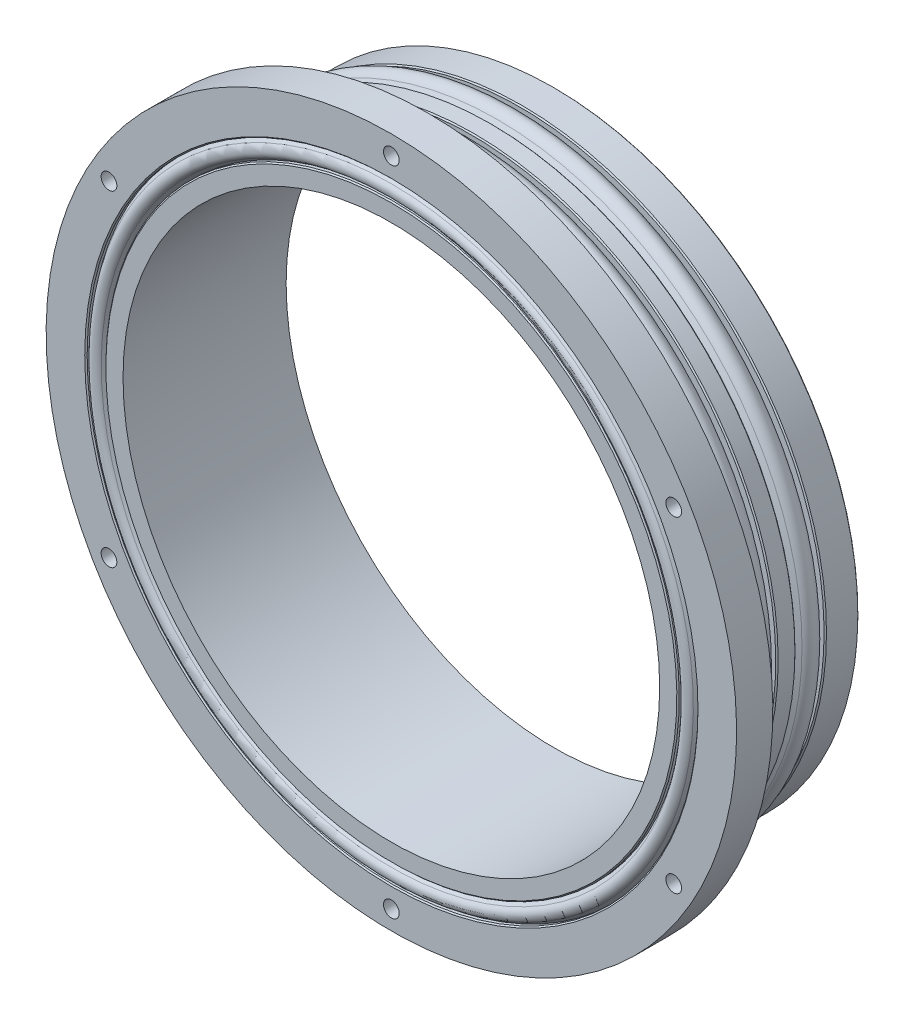
ISO-10303-21;
HEADER;
FILE_DESCRIPTION(('STEP AP214'),'2;1');
FILE_NAME('part.step','',(''),(''),'','','');
FILE_SCHEMA(('AUTOMOTIVE_DESIGN { 1 0 10303 214 1 1 1 1 }'));
ENDSEC;
DATA;
#1=APPLICATION_CONTEXT('core data for automotive mechanical design processes');
#2=APPLICATION_PROTOCOL_DEFINITION('international standard','automotive_design',2000,#1);
#3=PRODUCT_CONTEXT('',#1,'mechanical');
#4=PRODUCT('Part','Part','',(#3));
#5=PRODUCT_RELATED_PRODUCT_CATEGORY('part','',(#4));
#6=PRODUCT_DEFINITION_FORMATION('','',#4);
#7=PRODUCT_DEFINITION_CONTEXT('part definition',#1,'design');
#8=PRODUCT_DEFINITION('design','',#6,#7);
#9=PRODUCT_DEFINITION_SHAPE('','',#8);
#10=(LENGTH_UNIT() NAMED_UNIT(*) SI_UNIT(.MILLI.,.METRE.));
#11=(NAMED_UNIT(*) PLANE_ANGLE_UNIT() SI_UNIT($,.RADIAN.));
#12=(NAMED_UNIT(*) SI_UNIT($,.STERADIAN.) SOLID_ANGLE_UNIT());
#13=UNCERTAINTY_MEASURE_WITH_UNIT(LENGTH_MEASURE(1.E-05),#10,'distance_accuracy_value','');
#14=(GEOMETRIC_REPRESENTATION_CONTEXT(3) GLOBAL_UNCERTAINTY_ASSIGNED_CONTEXT((#13)) GLOBAL_UNIT_ASSIGNED_CONTEXT((#10,
#11,#12)) REPRESENTATION_CONTEXT('',''));
#15=CARTESIAN_POINT('',(0.,0.,0.));
#16=DIRECTION('',(0.,0.,1.));
#17=DIRECTION('',(1.,0.,0.));
#18=AXIS2_PLACEMENT_3D('',#15,#16,#17);
#19=CARTESIAN_POINT('',(0.,0.,0.));
#20=DIRECTION('',(0.,0.,-1.));
#21=DIRECTION('',(0.,1.,0.));
#22=AXIS2_PLACEMENT_3D('',#19,#20,#21);
#23=PLANE('',#22);
#24=CARTESIAN_POINT('',(0.,0.,0.));
#25=DIRECTION('',(0.,0.,-1.));
#26=DIRECTION('',(0.,1.,0.));
#27=AXIS2_PLACEMENT_3D('',#24,#25,#26);
#28=CIRCLE('',#27,50.219);
#29=CARTESIAN_POINT('',(0.,50.219,0.));
#30=VERTEX_POINT('',#29);
#31=EDGE_CURVE('E50',#30,#30,#28,.T.);
#32=ORIENTED_EDGE('',*,*,#31,.T.);
#33=EDGE_LOOP('',(#32));
#34=FACE_BOUND('',#33,.T.);
#35=CARTESIAN_POINT('',(0.,-46.99,0.));
#36=DIRECTION('',(0.,0.,-1.));
#37=DIRECTION('',(0.,1.,0.));
#38=AXIS2_PLACEMENT_3D('',#35,#36,#37);
#39=CIRCLE('',#38,1.29999999999999);
#40=CARTESIAN_POINT('',(0.,-45.69,0.));
#41=VERTEX_POINT('',#40);
#42=EDGE_CURVE('E137',#41,#41,#39,.T.);
#43=ORIENTED_EDGE('',*,*,#42,.F.);
#44=EDGE_LOOP('',(#43));
#45=FACE_BOUND('',#44,.T.);
#46=CARTESIAN_POINT('',(-46.99,0.,0.));
#47=DIRECTION('',(0.,0.,-1.));
#48=DIRECTION('',(0.,1.,0.));
#49=AXIS2_PLACEMENT_3D('',#46,#47,#48);
#50=CIRCLE('',#49,1.29999999999999);
#51=CARTESIAN_POINT('',(-46.99,1.29999999999999,0.));
#52=VERTEX_POINT('',#51);
#53=EDGE_CURVE('E143',#52,#52,#50,.T.);
#54=ORIENTED_EDGE('',*,*,#53,.F.);
#55=EDGE_LOOP('',(#54));
#56=FACE_BOUND('',#55,.T.);
#57=CARTESIAN_POINT('',(0.,46.99,0.));
#58=DIRECTION('',(0.,0.,-1.));
#59=DIRECTION('',(0.,1.,0.));
#60=AXIS2_PLACEMENT_3D('',#57,#58,#59);
#61=CIRCLE('',#60,1.29999999999999);
#62=CARTESIAN_POINT('',(0.,48.29,0.));
#63=VERTEX_POINT('',#62);
#64=EDGE_CURVE('E149',#63,#63,#61,.T.);
#65=ORIENTED_EDGE('',*,*,#64,.F.);
#66=EDGE_LOOP('',(#65));
#67=FACE_BOUND('',#66,.T.);
#68=CARTESIAN_POINT('',(46.99,0.,0.));
#69=DIRECTION('',(0.,0.,-1.));
#70=DIRECTION('',(0.,1.,0.));
#71=AXIS2_PLACEMENT_3D('',#68,#69,#70);
#72=CIRCLE('',#71,1.29999999999999);
#73=CARTESIAN_POINT('',(46.99,1.29999999999999,0.));
#74=VERTEX_POINT('',#73);
#75=EDGE_CURVE('E155',#74,#74,#72,.T.);
#76=ORIENTED_EDGE('',*,*,#75,.F.);
#77=EDGE_LOOP('',(#76));
#78=FACE_BOUND('',#77,.T.);
#79=CARTESIAN_POINT('',(0.,0.,0.));
#80=DIRECTION('',(0.,0.,1.));
#81=DIRECTION('',(1.,0.,0.));
#82=AXIS2_PLACEMENT_3D('',#79,#80,#81);
#83=CIRCLE('',#82,44.419);
#84=CARTESIAN_POINT('',(44.419,0.,0.));
#85=VERTEX_POINT('',#84);
#86=EDGE_CURVE('E185',#85,#85,#83,.T.);
#87=ORIENTED_EDGE('',*,*,#86,.T.);
#88=EDGE_LOOP('',(#87));
#89=FACE_BOUND('',#88,.T.);
#90=ADVANCED_FACE('F30',(#34,#45,#56,#67,#78,#89),#23,.T.);
#91=CARTESIAN_POINT('',(0.,0.,26.8));
#92=DIRECTION('',(0.,0.,-1.));
#93=DIRECTION('',(0.,1.,0.));
#94=AXIS2_PLACEMENT_3D('',#91,#92,#93);
#95=CONICAL_SURFACE('',#94,47.4599,0.785398163397388);
#96=CARTESIAN_POINT('',(0.,0.,27.));
#97=DIRECTION('',(0.,0.,-1.));
#98=DIRECTION('',(0.,1.,0.));
#99=AXIS2_PLACEMENT_3D('',#96,#97,#98);
#100=CIRCLE('',#99,47.2599);
#101=CARTESIAN_POINT('',(0.,47.2599,27.));
#102=VERTEX_POINT('',#101);
#103=EDGE_CURVE('E74',#102,#102,#100,.T.);
#104=ORIENTED_EDGE('',*,*,#103,.T.);
#105=EDGE_LOOP('',(#104));
#106=FACE_BOUND('',#105,.T.);
#107=CARTESIAN_POINT('',(0.,0.,26.8));
#108=DIRECTION('',(0.,0.,-1.));
#109=DIRECTION('',(0.,1.,0.));
#110=AXIS2_PLACEMENT_3D('',#107,#108,#109);
#111=CIRCLE('',#110,47.4599);
#112=CARTESIAN_POINT('',(0.,47.4599,26.8));
#113=VERTEX_POINT('',#112);
#114=EDGE_CURVE('E131',#113,#113,#111,.T.);
#115=ORIENTED_EDGE('',*,*,#114,.F.);
#116=EDGE_LOOP('',(#115));
#117=FACE_BOUND('',#116,.T.);
#118=ADVANCED_FACE('F198',(#106,#117),#95,.T.);
#119=CARTESIAN_POINT('',(47.2599,0.,27.));
#120=DIRECTION('',(0.,0.,1.));
#121=DIRECTION('',(0.,-1.,0.));
#122=AXIS2_PLACEMENT_3D('',#119,#120,#121);
#123=PLANE('',#122);
#124=CARTESIAN_POINT('',(0.,0.,27.));
#125=DIRECTION('',(0.,0.,1.));
#126=DIRECTION('',(1.,0.,0.));
#127=AXIS2_PLACEMENT_3D('',#124,#125,#126);
#128=CIRCLE('',#127,44.419);
#129=CARTESIAN_POINT('',(44.419,0.,27.));
#130=VERTEX_POINT('',#129);
#131=EDGE_CURVE('E188',#130,#130,#128,.T.);
#132=ORIENTED_EDGE('',*,*,#131,.F.);
#133=EDGE_LOOP('',(#132));
#134=FACE_BOUND('',#133,.T.);
#135=ORIENTED_EDGE('',*,*,#103,.F.);
#136=EDGE_LOOP('',(#135));
#137=FACE_BOUND('',#136,.T.);
#138=ADVANCED_FACE('F194',(#134,#137),#123,.T.);
#139=CARTESIAN_POINT('',(0.,0.,27.5266928789603));
#140=DIRECTION('',(0.,0.,-1.));
#141=DIRECTION('',(0.,1.,0.));
#142=AXIS2_PLACEMENT_3D('',#139,#140,#141);
#143=CYLINDRICAL_SURFACE('',#142,50.419);
#144=CARTESIAN_POINT('',(0.,0.,5.38700000000002));
#145=DIRECTION('',(0.,0.,1.));
#146=DIRECTION('',(0.,-1.,0.));
#147=AXIS2_PLACEMENT_3D('',#144,#145,#146);
#148=CIRCLE('',#147,50.419);
#149=CARTESIAN_POINT('',(0.,-50.419,5.38700000000001));
#150=VERTEX_POINT('',#149);
#151=EDGE_CURVE('E68',#150,#150,#148,.F.);
#152=ORIENTED_EDGE('',*,*,#151,.T.);
#153=EDGE_LOOP('',(#152));
#154=FACE_BOUND('',#153,.T.);
#155=CARTESIAN_POINT('',(0.,0.,0.200000000000002));
#156=DIRECTION('',(0.,0.,-1.));
#157=DIRECTION('',(0.,1.,0.));
#158=AXIS2_PLACEMENT_3D('',#155,#156,#157);
#159=CIRCLE('',#158,50.419);
#160=CARTESIAN_POINT('',(0.,50.419,0.200000000000008));
#161=VERTEX_POINT('',#160);
#162=EDGE_CURVE('E71',#161,#161,#159,.F.);
#163=ORIENTED_EDGE('',*,*,#162,.T.);
#164=EDGE_LOOP('',(#163));
#165=FACE_BOUND('',#164,.T.);
#166=ADVANCED_FACE('F197',(#154,#165),#143,.T.);
#167=CARTESIAN_POINT('',(50.419,0.,5.587));
#168=DIRECTION('',(0.,0.,1.));
#169=DIRECTION('',(0.,-1.,0.));
#170=AXIS2_PLACEMENT_3D('',#167,#168,#169);
#171=PLANE('',#170);
#172=CARTESIAN_POINT('',(0.,0.,5.587));
#173=DIRECTION('',(0.,0.,1.));
#174=DIRECTION('',(0.,-1.,0.));
#175=AXIS2_PLACEMENT_3D('',#172,#173,#174);
#176=CIRCLE('',#175,50.219);
#177=CARTESIAN_POINT('',(0.,-50.219,5.587));
#178=VERTEX_POINT('',#177);
#179=EDGE_CURVE('E65',#178,#178,#176,.T.);
#180=ORIENTED_EDGE('',*,*,#179,.T.);
#181=EDGE_LOOP('',(#180));
#182=FACE_BOUND('',#181,.T.);
#183=CARTESIAN_POINT('',(0.,0.,5.58700000000001));
#184=DIRECTION('',(0.,0.,-1.));
#185=DIRECTION('',(0.,1.,0.));
#186=AXIS2_PLACEMENT_3D('',#183,#184,#185);
#187=CIRCLE('',#186,49.04105);
#188=CARTESIAN_POINT('',(0.,49.04105,5.58700000000001));
#189=VERTEX_POINT('',#188);
#190=EDGE_CURVE('E86',#189,#189,#187,.T.);
#191=ORIENTED_EDGE('',*,*,#190,.T.);
#192=EDGE_LOOP('',(#191));
#193=FACE_BOUND('',#192,.T.);
#194=ADVANCED_FACE('F347',(#182,#193),#171,.T.);
#195=CARTESIAN_POINT('',(0.,0.,5.58700000000001));
#196=DIRECTION('',(0.,0.,1.));
#197=DIRECTION('',(0.,-1.,0.));
#198=AXIS2_PLACEMENT_3D('',#195,#196,#197);
#199=CONICAL_SURFACE('',#198,49.04105,0.966336052037737);
#200=CARTESIAN_POINT('',(0.,0.,6.54749535514835));
#201=DIRECTION('',(0.,0.,-1.));
#202=DIRECTION('',(0.,1.,0.));
#203=AXIS2_PLACEMENT_3D('',#200,#201,#202);
#204=CIRCLE('',#203,50.4316518859611);
#205=CARTESIAN_POINT('',(0.,50.4316518859611,6.54749535514835));
#206=VERTEX_POINT('',#205);
#207=EDGE_CURVE('E89',#206,#206,#204,.T.);
#208=ORIENTED_EDGE('',*,*,#207,.T.);
#209=EDGE_LOOP('',(#208));
#210=FACE_BOUND('',#209,.T.);
#211=ORIENTED_EDGE('',*,*,#190,.F.);
#212=EDGE_LOOP('',(#211));
#213=FACE_BOUND('',#212,.T.);
#214=ADVANCED_FACE('F344',(#210,#213),#199,.T.);
#215=CARTESIAN_POINT('',(0.,0.,8.));
#216=DIRECTION('',(0.,0.,-1.));
#217=DIRECTION('',(0.,1.,0.));
#218=AXIS2_PLACEMENT_3D('',#215,#216,#217);
#219=TOROIDAL_SURFACE('',#218,49.4284,1.76530000000002);
#220=CARTESIAN_POINT('',(0.,0.,9.45250464485163));
#221=DIRECTION('',(0.,0.,-1.));
#222=DIRECTION('',(0.,1.,0.));
#223=AXIS2_PLACEMENT_3D('',#220,#221,#222);
#224=CIRCLE('',#223,50.4316518859611);
#225=CARTESIAN_POINT('',(0.,50.4316518859611,9.45250464485164));
#226=VERTEX_POINT('',#225);
#227=EDGE_CURVE('E92',#226,#226,#224,.T.);
#228=ORIENTED_EDGE('',*,*,#227,.T.);
#229=EDGE_LOOP('',(#228));
#230=FACE_BOUND('',#229,.T.);
#231=ORIENTED_EDGE('',*,*,#207,.F.);
#232=EDGE_LOOP('',(#231));
#233=FACE_BOUND('',#232,.T.);
#234=ADVANCED_FACE('F340',(#230,#233),#219,.T.);
#235=CARTESIAN_POINT('',(0.,0.,9.45250464485163));
#236=DIRECTION('',(0.,0.,-1.));
#237=DIRECTION('',(0.,1.,0.));
#238=AXIS2_PLACEMENT_3D('',#235,#236,#237);
#239=CONICAL_SURFACE('',#238,50.4316518859611,0.966336052037737);
#240=CARTESIAN_POINT('',(0.,0.,10.413));
#241=DIRECTION('',(0.,0.,-1.));
#242=DIRECTION('',(0.,1.,0.));
#243=AXIS2_PLACEMENT_3D('',#240,#241,#242);
#244=CIRCLE('',#243,49.04105);
#245=CARTESIAN_POINT('',(0.,49.04105,10.413));
#246=VERTEX_POINT('',#245);
#247=EDGE_CURVE('E95',#246,#246,#244,.T.);
#248=ORIENTED_EDGE('',*,*,#247,.T.);
#249=EDGE_LOOP('',(#248));
#250=FACE_BOUND('',#249,.T.);
#251=ORIENTED_EDGE('',*,*,#227,.F.);
#252=EDGE_LOOP('',(#251));
#253=FACE_BOUND('',#252,.T.);
#254=ADVANCED_FACE('F336',(#250,#253),#239,.T.);
#255=CARTESIAN_POINT('',(49.04105,0.,10.413));
#256=DIRECTION('',(0.,0.,-1.));
#257=DIRECTION('',(0.,1.,0.));
#258=AXIS2_PLACEMENT_3D('',#255,#256,#257);
#259=PLANE('',#258);
#260=CARTESIAN_POINT('',(0.,0.,10.413));
#261=DIRECTION('',(0.,0.,-1.));
#262=DIRECTION('',(0.,1.,0.));
#263=AXIS2_PLACEMENT_3D('',#260,#261,#262);
#264=CIRCLE('',#263,50.2190000000001);
#265=CARTESIAN_POINT('',(0.,50.2190000000001,10.413));
#266=VERTEX_POINT('',#265);
#267=EDGE_CURVE('E53',#266,#266,#264,.T.);
#268=ORIENTED_EDGE('',*,*,#267,.T.);
#269=EDGE_LOOP('',(#268));
#270=FACE_BOUND('',#269,.T.);
#271=ORIENTED_EDGE('',*,*,#247,.F.);
#272=EDGE_LOOP('',(#271));
#273=FACE_BOUND('',#272,.T.);
#274=ADVANCED_FACE('F332',(#270,#273),#259,.T.);
#275=CARTESIAN_POINT('',(0.,0.,27.5266928789603));
#276=DIRECTION('',(0.,0.,-1.));
#277=DIRECTION('',(0.,1.,0.));
#278=AXIS2_PLACEMENT_3D('',#275,#276,#277);
#279=CYLINDRICAL_SURFACE('',#278,50.419);
#280=CARTESIAN_POINT('',(0.,0.,13.387));
#281=DIRECTION('',(0.,0.,1.));
#282=DIRECTION('',(0.,-1.,0.));
#283=AXIS2_PLACEMENT_3D('',#280,#281,#282);
#284=CIRCLE('',#283,50.419);
#285=CARTESIAN_POINT('',(0.,-50.419,13.387));
#286=VERTEX_POINT('',#285);
#287=EDGE_CURVE('E59',#286,#286,#284,.F.);
#288=ORIENTED_EDGE('',*,*,#287,.T.);
#289=EDGE_LOOP('',(#288));
#290=FACE_BOUND('',#289,.T.);
#291=CARTESIAN_POINT('',(0.,0.,10.613));
#292=DIRECTION('',(0.,0.,-1.));
#293=DIRECTION('',(0.,1.,0.));
#294=AXIS2_PLACEMENT_3D('',#291,#292,#293);
#295=CIRCLE('',#294,50.419);
#296=CARTESIAN_POINT('',(0.,50.419,10.613));
#297=VERTEX_POINT('',#296);
#298=EDGE_CURVE('E62',#297,#297,#295,.F.);
#299=ORIENTED_EDGE('',*,*,#298,.T.);
#300=EDGE_LOOP('',(#299));
#301=FACE_BOUND('',#300,.T.);
#302=ADVANCED_FACE('F328',(#290,#301),#279,.T.);
#303=CARTESIAN_POINT('',(50.419,0.,13.587));
#304=DIRECTION('',(0.,0.,1.));
#305=DIRECTION('',(0.,-1.,0.));
#306=AXIS2_PLACEMENT_3D('',#303,#304,#305);
#307=PLANE('',#306);
#308=CARTESIAN_POINT('',(0.,0.,13.587));
#309=DIRECTION('',(0.,0.,1.));
#310=DIRECTION('',(0.,-1.,0.));
#311=AXIS2_PLACEMENT_3D('',#308,#309,#310);
#312=CIRCLE('',#311,50.219);
#313=CARTESIAN_POINT('',(0.,-50.219,13.587));
#314=VERTEX_POINT('',#313);
#315=EDGE_CURVE('E56',#314,#314,#312,.T.);
#316=ORIENTED_EDGE('',*,*,#315,.T.);
#317=EDGE_LOOP('',(#316));
#318=FACE_BOUND('',#317,.T.);
#319=CARTESIAN_POINT('',(0.,0.,13.587));
#320=DIRECTION('',(0.,0.,-1.));
#321=DIRECTION('',(0.,1.,0.));
#322=AXIS2_PLACEMENT_3D('',#319,#320,#321);
#323=CIRCLE('',#322,49.0410500000001);
#324=CARTESIAN_POINT('',(0.,49.0410500000001,13.587));
#325=VERTEX_POINT('',#324);
#326=EDGE_CURVE('E98',#325,#325,#323,.T.);
#327=ORIENTED_EDGE('',*,*,#326,.T.);
#328=EDGE_LOOP('',(#327));
#329=FACE_BOUND('',#328,.T.);
#330=ADVANCED_FACE('F324',(#318,#329),#307,.T.);
#331=CARTESIAN_POINT('',(0.,0.,13.587));
#332=DIRECTION('',(0.,0.,1.));
#333=DIRECTION('',(0.,-1.,0.));
#334=AXIS2_PLACEMENT_3D('',#331,#332,#333);
#335=CONICAL_SURFACE('',#334,49.0410500000001,0.966336052037725);
#336=CARTESIAN_POINT('',(0.,0.,14.5474953551483));
#337=DIRECTION('',(0.,0.,-1.));
#338=DIRECTION('',(0.,1.,0.));
#339=AXIS2_PLACEMENT_3D('',#336,#337,#338);
#340=CIRCLE('',#339,50.4316518859611);
#341=CARTESIAN_POINT('',(0.,50.4316518859611,14.5474953551483));
#342=VERTEX_POINT('',#341);
#343=EDGE_CURVE('E101',#342,#342,#340,.T.);
#344=ORIENTED_EDGE('',*,*,#343,.T.);
#345=EDGE_LOOP('',(#344));
#346=FACE_BOUND('',#345,.T.);
#347=ORIENTED_EDGE('',*,*,#326,.F.);
#348=EDGE_LOOP('',(#347));
#349=FACE_BOUND('',#348,.T.);
#350=ADVANCED_FACE('F320',(#346,#349),#335,.T.);
#351=CARTESIAN_POINT('',(0.,0.,16.));
#352=DIRECTION('',(0.,0.,-1.));
#353=DIRECTION('',(0.,1.,0.));
#354=AXIS2_PLACEMENT_3D('',#351,#352,#353);
#355=TOROIDAL_SURFACE('',#354,49.4284,1.76530000000002);
#356=CARTESIAN_POINT('',(0.,0.,17.4525046448516));
#357=DIRECTION('',(0.,0.,-1.));
#358=DIRECTION('',(0.,1.,0.));
#359=AXIS2_PLACEMENT_3D('',#356,#357,#358);
#360=CIRCLE('',#359,50.4316518859611);
#361=CARTESIAN_POINT('',(0.,50.4316518859611,17.4525046448516));
#362=VERTEX_POINT('',#361);
#363=EDGE_CURVE('E104',#362,#362,#360,.T.);
#364=ORIENTED_EDGE('',*,*,#363,.T.);
#365=EDGE_LOOP('',(#364));
#366=FACE_BOUND('',#365,.T.);
#367=ORIENTED_EDGE('',*,*,#343,.F.);
#368=EDGE_LOOP('',(#367));
#369=FACE_BOUND('',#368,.T.);
#370=ADVANCED_FACE('F316',(#366,#369),#355,.T.);
#371=CARTESIAN_POINT('',(0.,0.,17.4525046448516));
#372=DIRECTION('',(0.,0.,-1.));
#373=DIRECTION('',(0.,1.,0.));
#374=AXIS2_PLACEMENT_3D('',#371,#372,#373);
#375=CONICAL_SURFACE('',#374,50.4316518859611,0.966336052037739);
#376=CARTESIAN_POINT('',(0.,0.,18.413));
#377=DIRECTION('',(0.,0.,-1.));
#378=DIRECTION('',(0.,1.,0.));
#379=AXIS2_PLACEMENT_3D('',#376,#377,#378);
#380=CIRCLE('',#379,49.04105);
#381=CARTESIAN_POINT('',(0.,49.04105,18.413));
#382=VERTEX_POINT('',#381);
#383=EDGE_CURVE('E107',#382,#382,#380,.T.);
#384=ORIENTED_EDGE('',*,*,#383,.T.);
#385=EDGE_LOOP('',(#384));
#386=FACE_BOUND('',#385,.T.);
#387=ORIENTED_EDGE('',*,*,#363,.F.);
#388=EDGE_LOOP('',(#387));
#389=FACE_BOUND('',#388,.T.);
#390=ADVANCED_FACE('F311',(#386,#389),#375,.T.);
#391=CARTESIAN_POINT('',(49.04105,0.,18.413));
#392=DIRECTION('',(0.,0.,-1.));
#393=DIRECTION('',(0.,1.,0.));
#394=AXIS2_PLACEMENT_3D('',#391,#392,#393);
#395=PLANE('',#394);
#396=CARTESIAN_POINT('',(0.,0.,18.413));
#397=DIRECTION('',(0.,0.,-1.));
#398=DIRECTION('',(0.,1.,0.));
#399=AXIS2_PLACEMENT_3D('',#396,#397,#398);
#400=CIRCLE('',#399,50.219);
#401=CARTESIAN_POINT('',(0.,50.219,18.413));
#402=VERTEX_POINT('',#401);
#403=EDGE_CURVE('E37',#402,#402,#400,.T.);
#404=ORIENTED_EDGE('',*,*,#403,.T.);
#405=EDGE_LOOP('',(#404));
#406=FACE_BOUND('',#405,.T.);
#407=ORIENTED_EDGE('',*,*,#383,.F.);
#408=EDGE_LOOP('',(#407));
#409=FACE_BOUND('',#408,.T.);
#410=ADVANCED_FACE('F306',(#406,#409),#395,.T.);
#411=CARTESIAN_POINT('',(0.,0.,27.5266928789603));
#412=DIRECTION('',(0.,0.,-1.));
#413=DIRECTION('',(0.,1.,0.));
#414=AXIS2_PLACEMENT_3D('',#411,#412,#413);
#415=CYLINDRICAL_SURFACE('',#414,50.419);
#416=CARTESIAN_POINT('',(0.,0.,18.613));
#417=DIRECTION('',(0.,0.,-1.));
#418=DIRECTION('',(0.,1.,0.));
#419=AXIS2_PLACEMENT_3D('',#416,#417,#418);
#420=CIRCLE('',#419,50.419);
#421=CARTESIAN_POINT('',(0.,50.419,18.613));
#422=VERTEX_POINT('',#421);
#423=EDGE_CURVE('E10',#422,#422,#420,.F.);
#424=ORIENTED_EDGE('',*,*,#423,.T.);
#425=EDGE_LOOP('',(#424));
#426=FACE_BOUND('',#425,.T.);
#427=CARTESIAN_POINT('',(0.,0.,21.));
#428=DIRECTION('',(0.,0.,-1.));
#429=DIRECTION('',(0.,1.,0.));
#430=AXIS2_PLACEMENT_3D('',#427,#428,#429);
#431=CIRCLE('',#430,50.419);
#432=CARTESIAN_POINT('',(0.,50.419,21.));
#433=VERTEX_POINT('',#432);
#434=EDGE_CURVE('E110',#433,#433,#431,.T.);
#435=ORIENTED_EDGE('',*,*,#434,.T.);
#436=EDGE_LOOP('',(#435));
#437=FACE_BOUND('',#436,.T.);
#438=ADVANCED_FACE('F300',(#426,#437),#415,.T.);
#439=CARTESIAN_POINT('',(50.419,0.,21.));
#440=DIRECTION('',(0.,0.,-1.));
#441=DIRECTION('',(0.,1.,0.));
#442=AXIS2_PLACEMENT_3D('',#439,#440,#441);
#443=PLANE('',#442);
#444=CARTESIAN_POINT('',(0.,53.975,21.));
#445=DIRECTION('',(0.,0.,-1.));
#446=DIRECTION('',(0.,1.,0.));
#447=AXIS2_PLACEMENT_3D('',#444,#445,#446);
#448=CIRCLE('',#447,1.29999999999999);
#449=CARTESIAN_POINT('',(0.,55.275,21.));
#450=VERTEX_POINT('',#449);
#451=EDGE_CURVE('E182',#450,#450,#448,.T.);
#452=ORIENTED_EDGE('',*,*,#451,.F.);
#453=EDGE_LOOP('',(#452));
#454=FACE_BOUND('',#453,.T.);
#455=CARTESIAN_POINT('',(46.7437211692651,26.9875,21.));
#456=DIRECTION('',(0.,0.,-1.));
#457=DIRECTION('',(0.,1.,0.));
#458=AXIS2_PLACEMENT_3D('',#455,#456,#457);
#459=CIRCLE('',#458,1.29999999999999);
#460=CARTESIAN_POINT('',(46.7437211692651,28.2875,21.));
#461=VERTEX_POINT('',#460);
#462=EDGE_CURVE('E79',#461,#461,#459,.T.);
#463=ORIENTED_EDGE('',*,*,#462,.F.);
#464=EDGE_LOOP('',(#463));
#465=FACE_BOUND('',#464,.T.);
#466=CARTESIAN_POINT('',(46.7437211692651,-26.9875,21.));
#467=DIRECTION('',(0.,0.,-1.));
#468=DIRECTION('',(0.,1.,0.));
#469=AXIS2_PLACEMENT_3D('',#466,#467,#468);
#470=CIRCLE('',#469,1.29999999999999);
#471=CARTESIAN_POINT('',(46.7437211692651,-25.6875,21.));
#472=VERTEX_POINT('',#471);
#473=EDGE_CURVE('E78',#472,#472,#470,.T.);
#474=ORIENTED_EDGE('',*,*,#473,.F.);
#475=EDGE_LOOP('',(#474));
#476=FACE_BOUND('',#475,.T.);
#477=CARTESIAN_POINT('',(0.,-53.975,21.));
#478=DIRECTION('',(0.,0.,-1.));
#479=DIRECTION('',(0.,1.,0.));
#480=AXIS2_PLACEMENT_3D('',#477,#478,#479);
#481=CIRCLE('',#480,1.29999999999999);
#482=CARTESIAN_POINT('',(0.,-52.675,21.));
#483=VERTEX_POINT('',#482);
#484=EDGE_CURVE('E83',#483,#483,#481,.T.);
#485=ORIENTED_EDGE('',*,*,#484,.F.);
#486=EDGE_LOOP('',(#485));
#487=FACE_BOUND('',#486,.T.);
#488=CARTESIAN_POINT('',(-46.7437211692651,-26.9875,21.));
#489=DIRECTION('',(0.,0.,-1.));
#490=DIRECTION('',(0.,1.,0.));
#491=AXIS2_PLACEMENT_3D('',#488,#489,#490);
#492=CIRCLE('',#491,1.29999999999999);
#493=CARTESIAN_POINT('',(-46.7437211692651,-25.6875,21.));
#494=VERTEX_POINT('',#493);
#495=EDGE_CURVE('E167',#494,#494,#492,.T.);
#496=ORIENTED_EDGE('',*,*,#495,.F.);
#497=EDGE_LOOP('',(#496));
#498=FACE_BOUND('',#497,.T.);
#499=CARTESIAN_POINT('',(-46.7437211692651,26.9875,21.));
#500=DIRECTION('',(0.,0.,-1.));
#501=DIRECTION('',(0.,1.,0.));
#502=AXIS2_PLACEMENT_3D('',#499,#500,#501);
#503=CIRCLE('',#502,1.29999999999999);
#504=CARTESIAN_POINT('',(-46.7437211692651,28.2875,21.));
#505=VERTEX_POINT('',#504);
#506=EDGE_CURVE('E161',#505,#505,#503,.T.);
#507=ORIENTED_EDGE('',*,*,#506,.F.);
#508=EDGE_LOOP('',(#507));
#509=FACE_BOUND('',#508,.T.);
#510=CARTESIAN_POINT('',(0.,0.,21.));
#511=DIRECTION('',(0.,0.,-1.));
#512=DIRECTION('',(0.,1.,0.));
#513=AXIS2_PLACEMENT_3D('',#510,#511,#512);
#514=CIRCLE('',#513,57.15);
#515=CARTESIAN_POINT('',(0.,57.15,21.));
#516=VERTEX_POINT('',#515);
#517=EDGE_CURVE('E113',#516,#516,#514,.T.);
#518=ORIENTED_EDGE('',*,*,#517,.T.);
#519=EDGE_LOOP('',(#518));
#520=FACE_BOUND('',#519,.T.);
#521=ORIENTED_EDGE('',*,*,#434,.F.);
#522=EDGE_LOOP('',(#521));
#523=FACE_BOUND('',#522,.T.);
#524=ADVANCED_FACE('F294',(#454,#465,#476,#487,#498,#509,#520,#523),#443,.T.);
#525=CARTESIAN_POINT('',(0.,0.,27.5266928789603));
#526=DIRECTION('',(0.,0.,-1.));
#527=DIRECTION('',(0.,1.,0.));
#528=AXIS2_PLACEMENT_3D('',#525,#526,#527);
#529=CYLINDRICAL_SURFACE('',#528,57.15);
#530=CARTESIAN_POINT('',(0.,0.,27.));
#531=DIRECTION('',(0.,0.,-1.));
#532=DIRECTION('',(0.,1.,0.));
#533=AXIS2_PLACEMENT_3D('',#530,#531,#532);
#534=CIRCLE('',#533,57.15);
#535=CARTESIAN_POINT('',(0.,57.15,27.));
#536=VERTEX_POINT('',#535);
#537=EDGE_CURVE('E116',#536,#536,#534,.T.);
#538=ORIENTED_EDGE('',*,*,#537,.T.);
#539=EDGE_LOOP('',(#538));
#540=FACE_BOUND('',#539,.T.);
#541=ORIENTED_EDGE('',*,*,#517,.F.);
#542=EDGE_LOOP('',(#541));
#543=FACE_BOUND('',#542,.T.);
#544=ADVANCED_FACE('F240',(#540,#543),#529,.T.);
#545=CARTESIAN_POINT('',(57.15,0.,27.));
#546=DIRECTION('',(0.,0.,1.));
#547=DIRECTION('',(0.,-1.,0.));
#548=AXIS2_PLACEMENT_3D('',#545,#546,#547);
#549=PLANE('',#548);
#550=CARTESIAN_POINT('',(0.,0.,27.));
#551=DIRECTION('',(0.,0.,1.));
#552=DIRECTION('',(0.,-1.,0.));
#553=AXIS2_PLACEMENT_3D('',#550,#551,#552);
#554=CIRCLE('',#553,50.7587);
#555=CARTESIAN_POINT('',(0.,-50.7587,27.));
#556=VERTEX_POINT('',#555);
#557=EDGE_CURVE('E45',#556,#556,#554,.F.);
#558=ORIENTED_EDGE('',*,*,#557,.T.);
#559=EDGE_LOOP('',(#558));
#560=FACE_BOUND('',#559,.T.);
#561=CARTESIAN_POINT('',(0.,53.975,27.));
#562=DIRECTION('',(0.,0.,1.));
#563=DIRECTION('',(0.,-1.,0.));
#564=AXIS2_PLACEMENT_3D('',#561,#562,#563);
#565=CIRCLE('',#564,1.29999999999999);
#566=CARTESIAN_POINT('',(0.,52.675,27.));
#567=VERTEX_POINT('',#566);
#568=EDGE_CURVE('E179',#567,#567,#565,.T.);
#569=ORIENTED_EDGE('',*,*,#568,.F.);
#570=EDGE_LOOP('',(#569));
#571=FACE_BOUND('',#570,.T.);
#572=CARTESIAN_POINT('',(46.7437211692651,26.9875,27.));
#573=DIRECTION('',(0.,0.,1.));
#574=DIRECTION('',(0.,-1.,0.));
#575=AXIS2_PLACEMENT_3D('',#572,#573,#574);
#576=CIRCLE('',#575,1.29999999999999);
#577=CARTESIAN_POINT('',(46.7437211692651,25.6875,27.));
#578=VERTEX_POINT('',#577);
#579=EDGE_CURVE('E75',#578,#578,#576,.T.);
#580=ORIENTED_EDGE('',*,*,#579,.F.);
#581=EDGE_LOOP('',(#580));
#582=FACE_BOUND('',#581,.T.);
#583=CARTESIAN_POINT('',(46.7437211692651,-26.9875,27.));
#584=DIRECTION('',(0.,0.,1.));
#585=DIRECTION('',(0.,-1.,0.));
#586=AXIS2_PLACEMENT_3D('',#583,#584,#585);
#587=CIRCLE('',#586,1.29999999999999);
#588=CARTESIAN_POINT('',(46.7437211692651,-28.2875,27.));
#589=VERTEX_POINT('',#588);
#590=EDGE_CURVE('E80',#589,#589,#587,.T.);
#591=ORIENTED_EDGE('',*,*,#590,.F.);
#592=EDGE_LOOP('',(#591));
#593=FACE_BOUND('',#592,.T.);
#594=CARTESIAN_POINT('',(0.,-53.975,27.));
#595=DIRECTION('',(0.,0.,1.));
#596=DIRECTION('',(0.,-1.,0.));
#597=AXIS2_PLACEMENT_3D('',#594,#595,#596);
#598=CIRCLE('',#597,1.29999999999999);
#599=CARTESIAN_POINT('',(0.,-55.275,27.));
#600=VERTEX_POINT('',#599);
#601=EDGE_CURVE('E170',#600,#600,#598,.T.);
#602=ORIENTED_EDGE('',*,*,#601,.F.);
#603=EDGE_LOOP('',(#602));
#604=FACE_BOUND('',#603,.T.);
#605=CARTESIAN_POINT('',(-46.7437211692651,-26.9875,27.));
#606=DIRECTION('',(0.,0.,1.));
#607=DIRECTION('',(0.,-1.,0.));
#608=AXIS2_PLACEMENT_3D('',#605,#606,#607);
#609=CIRCLE('',#608,1.29999999999999);
#610=CARTESIAN_POINT('',(-46.7437211692651,-28.2875,27.));
#611=VERTEX_POINT('',#610);
#612=EDGE_CURVE('E164',#611,#611,#609,.T.);
#613=ORIENTED_EDGE('',*,*,#612,.F.);
#614=EDGE_LOOP('',(#613));
#615=FACE_BOUND('',#614,.T.);
#616=CARTESIAN_POINT('',(-46.7437211692651,26.9875,27.));
#617=DIRECTION('',(0.,0.,1.));
#618=DIRECTION('',(0.,-1.,0.));
#619=AXIS2_PLACEMENT_3D('',#616,#617,#618);
#620=CIRCLE('',#619,1.29999999999999);
#621=CARTESIAN_POINT('',(-46.7437211692651,25.6875,27.));
#622=VERTEX_POINT('',#621);
#623=EDGE_CURVE('E158',#622,#622,#620,.T.);
#624=ORIENTED_EDGE('',*,*,#623,.F.);
#625=EDGE_LOOP('',(#624));
#626=FACE_BOUND('',#625,.T.);
#627=ORIENTED_EDGE('',*,*,#537,.F.);
#628=EDGE_LOOP('',(#627));
#629=FACE_BOUND('',#628,.T.);
#630=ADVANCED_FACE('F234',(#560,#571,#582,#593,#604,#615,#626,#629),#549,.T.);
#631=CARTESIAN_POINT('',(0.,0.,27.5266928789603));
#632=DIRECTION('',(0.,0.,-1.));
#633=DIRECTION('',(0.,1.,0.));
#634=AXIS2_PLACEMENT_3D('',#631,#632,#633);
#635=CYLINDRICAL_SURFACE('',#634,50.5587);
#636=CARTESIAN_POINT('',(0.,0.,26.8));
#637=DIRECTION('',(0.,0.,1.));
#638=DIRECTION('',(0.,-1.,0.));
#639=AXIS2_PLACEMENT_3D('',#636,#637,#638);
#640=CIRCLE('',#639,50.5587);
#641=CARTESIAN_POINT('',(0.,-50.5587,26.8));
#642=VERTEX_POINT('',#641);
#643=EDGE_CURVE('E41',#642,#642,#640,.T.);
#644=ORIENTED_EDGE('',*,*,#643,.T.);
#645=EDGE_LOOP('',(#644));
#646=FACE_BOUND('',#645,.T.);
#647=CARTESIAN_POINT('',(0.,0.,26.2791702351356));
#648=DIRECTION('',(0.,0.,-1.));
#649=DIRECTION('',(0.,1.,0.));
#650=AXIS2_PLACEMENT_3D('',#647,#648,#649);
#651=CIRCLE('',#650,50.5587);
#652=CARTESIAN_POINT('',(0.,50.5587,26.2791702351356));
#653=VERTEX_POINT('',#652);
#654=EDGE_CURVE('E119',#653,#653,#651,.T.);
#655=ORIENTED_EDGE('',*,*,#654,.T.);
#656=EDGE_LOOP('',(#655));
#657=FACE_BOUND('',#656,.T.);
#658=ADVANCED_FACE('F229',(#646,#657),#635,.F.);
#659=CARTESIAN_POINT('',(0.,0.,26.2791702351356));
#660=DIRECTION('',(0.,0.,-1.));
#661=DIRECTION('',(0.,1.,0.));
#662=AXIS2_PLACEMENT_3D('',#659,#660,#661);
#663=CONICAL_SURFACE('',#662,50.5587,0.634842696572097);
#664=CARTESIAN_POINT('',(0.,0.,27.0190146200091));
#665=DIRECTION('',(0.,0.,-1.));
#666=DIRECTION('',(0.,1.,0.));
#667=AXIS2_PLACEMENT_3D('',#664,#665,#666);
#668=CIRCLE('',#667,50.0137615637377);
#669=CARTESIAN_POINT('',(0.,50.0137615637377,27.0190146200091));
#670=VERTEX_POINT('',#669);
#671=EDGE_CURVE('E122',#670,#670,#668,.T.);
#672=ORIENTED_EDGE('',*,*,#671,.T.);
#673=EDGE_LOOP('',(#672));
#674=FACE_BOUND('',#673,.T.);
#675=ORIENTED_EDGE('',*,*,#654,.F.);
#676=EDGE_LOOP('',(#675));
#677=FACE_BOUND('',#676,.T.);
#678=ADVANCED_FACE('F223',(#674,#677),#663,.T.);
#679=CARTESIAN_POINT('',(0.,0.,26.2791702351357));
#680=DIRECTION('',(0.,0.,-1.));
#681=DIRECTION('',(0.,1.,0.));
#682=AXIS2_PLACEMENT_3D('',#679,#680,#681);
#683=TOROIDAL_SURFACE('',#682,49.0093,1.24752264382461);
#684=CARTESIAN_POINT('',(0.,0.,27.0190146200091));
#685=DIRECTION('',(0.,0.,-1.));
#686=DIRECTION('',(0.,1.,0.));
#687=AXIS2_PLACEMENT_3D('',#684,#685,#686);
#688=CIRCLE('',#687,48.0048384362623);
#689=CARTESIAN_POINT('',(0.,48.0048384362623,27.0190146200091));
#690=VERTEX_POINT('',#689);
#691=EDGE_CURVE('E125',#690,#690,#688,.T.);
#692=ORIENTED_EDGE('',*,*,#691,.T.);
#693=EDGE_LOOP('',(#692));
#694=FACE_BOUND('',#693,.T.);
#695=ORIENTED_EDGE('',*,*,#671,.F.);
#696=EDGE_LOOP('',(#695));
#697=FACE_BOUND('',#696,.T.);
#698=ADVANCED_FACE('F217',(#694,#697),#683,.T.);
#699=CARTESIAN_POINT('',(0.,0.,27.0190146200091));
#700=DIRECTION('',(0.,0.,1.));
#701=DIRECTION('',(0.,-1.,0.));
#702=AXIS2_PLACEMENT_3D('',#699,#700,#701);
#703=CONICAL_SURFACE('',#702,48.0048384362623,0.634842696572101);
#704=CARTESIAN_POINT('',(0.,0.,26.2791702351356));
#705=DIRECTION('',(0.,0.,-1.));
#706=DIRECTION('',(0.,1.,0.));
#707=AXIS2_PLACEMENT_3D('',#704,#705,#706);
#708=CIRCLE('',#707,47.4599);
#709=CARTESIAN_POINT('',(0.,47.4599,26.2791702351356));
#710=VERTEX_POINT('',#709);
#711=EDGE_CURVE('E128',#710,#710,#708,.T.);
#712=ORIENTED_EDGE('',*,*,#711,.T.);
#713=EDGE_LOOP('',(#712));
#714=FACE_BOUND('',#713,.T.);
#715=ORIENTED_EDGE('',*,*,#691,.F.);
#716=EDGE_LOOP('',(#715));
#717=FACE_BOUND('',#716,.T.);
#718=ADVANCED_FACE('F211',(#714,#717),#703,.F.);
#719=CARTESIAN_POINT('',(0.,0.,27.5266928789603));
#720=DIRECTION('',(0.,0.,-1.));
#721=DIRECTION('',(0.,1.,0.));
#722=AXIS2_PLACEMENT_3D('',#719,#720,#721);
#723=CYLINDRICAL_SURFACE('',#722,47.4599);
#724=ORIENTED_EDGE('',*,*,#114,.T.);
#725=EDGE_LOOP('',(#724));
#726=FACE_BOUND('',#725,.T.);
#727=ORIENTED_EDGE('',*,*,#711,.F.);
#728=EDGE_LOOP('',(#727));
#729=FACE_BOUND('',#728,.T.);
#730=ADVANCED_FACE('F207',(#726,#729),#723,.T.);
#731=CARTESIAN_POINT('',(0.,-46.99,3.99999999999999));
#732=DIRECTION('',(0.,0.,1.));
#733=DIRECTION('',(0.,-1.,0.));
#734=AXIS2_PLACEMENT_3D('',#731,#732,#733);
#735=PLANE('',#734);
#736=CARTESIAN_POINT('',(0.,-46.99,4.));
#737=DIRECTION('',(0.,0.,-1.));
#738=DIRECTION('',(0.,1.,0.));
#739=AXIS2_PLACEMENT_3D('',#736,#737,#738);
#740=CIRCLE('',#739,1.29999999999999);
#741=CARTESIAN_POINT('',(0.,-45.69,4.));
#742=VERTEX_POINT('',#741);
#743=EDGE_CURVE('E134',#742,#742,#740,.T.);
#744=ORIENTED_EDGE('',*,*,#743,.T.);
#745=EDGE_LOOP('',(#744));
#746=FACE_BOUND('',#745,.T.);
#747=ADVANCED_FACE('F210',(#746),#735,.F.);
#748=CARTESIAN_POINT('',(0.,-46.99,0.));
#749=DIRECTION('',(0.,0.,-1.));
#750=DIRECTION('',(0.,1.,0.));
#751=AXIS2_PLACEMENT_3D('',#748,#749,#750);
#752=CYLINDRICAL_SURFACE('',#751,1.29999999999999);
#753=ORIENTED_EDGE('',*,*,#743,.F.);
#754=EDGE_LOOP('',(#753));
#755=FACE_BOUND('',#754,.T.);
#756=ORIENTED_EDGE('',*,*,#42,.T.);
#757=EDGE_LOOP('',(#756));
#758=FACE_BOUND('',#757,.T.);
#759=ADVANCED_FACE('F459',(#755,#758),#752,.F.);
#760=CARTESIAN_POINT('',(-46.99,0.,4.));
#761=DIRECTION('',(0.,0.,1.));
#762=DIRECTION('',(0.,-1.,0.));
#763=AXIS2_PLACEMENT_3D('',#760,#761,#762);
#764=PLANE('',#763);
#765=CARTESIAN_POINT('',(-46.99,0.,4.));
#766=DIRECTION('',(0.,0.,-1.));
#767=DIRECTION('',(0.,1.,0.));
#768=AXIS2_PLACEMENT_3D('',#765,#766,#767);
#769=CIRCLE('',#768,1.29999999999999);
#770=CARTESIAN_POINT('',(-46.99,1.29999999999999,4.));
#771=VERTEX_POINT('',#770);
#772=EDGE_CURVE('E140',#771,#771,#769,.T.);
#773=ORIENTED_EDGE('',*,*,#772,.T.);
#774=EDGE_LOOP('',(#773));
#775=FACE_BOUND('',#774,.T.);
#776=ADVANCED_FACE('F469',(#775),#764,.F.);
#777=CARTESIAN_POINT('',(-46.99,0.,0.));
#778=DIRECTION('',(0.,0.,-1.));
#779=DIRECTION('',(0.,1.,0.));
#780=AXIS2_PLACEMENT_3D('',#777,#778,#779);
#781=CYLINDRICAL_SURFACE('',#780,1.29999999999999);
#782=ORIENTED_EDGE('',*,*,#772,.F.);
#783=EDGE_LOOP('',(#782));
#784=FACE_BOUND('',#783,.T.);
#785=ORIENTED_EDGE('',*,*,#53,.T.);
#786=EDGE_LOOP('',(#785));
#787=FACE_BOUND('',#786,.T.);
#788=ADVANCED_FACE('F479',(#784,#787),#781,.F.);
#789=CARTESIAN_POINT('',(0.,46.99,4.00000000000001));
#790=DIRECTION('',(0.,0.,1.));
#791=DIRECTION('',(0.,-1.,0.));
#792=AXIS2_PLACEMENT_3D('',#789,#790,#791);
#793=PLANE('',#792);
#794=CARTESIAN_POINT('',(0.,46.99,4.00000000000001));
#795=DIRECTION('',(0.,0.,-1.));
#796=DIRECTION('',(0.,1.,0.));
#797=AXIS2_PLACEMENT_3D('',#794,#795,#796);
#798=CIRCLE('',#797,1.29999999999999);
#799=CARTESIAN_POINT('',(0.,48.29,4.00000000000001));
#800=VERTEX_POINT('',#799);
#801=EDGE_CURVE('E146',#800,#800,#798,.T.);
#802=ORIENTED_EDGE('',*,*,#801,.T.);
#803=EDGE_LOOP('',(#802));
#804=FACE_BOUND('',#803,.T.);
#805=ADVANCED_FACE('F489',(#804),#793,.F.);
#806=CARTESIAN_POINT('',(0.,46.99,0.));
#807=DIRECTION('',(0.,0.,-1.));
#808=DIRECTION('',(0.,1.,0.));
#809=AXIS2_PLACEMENT_3D('',#806,#807,#808);
#810=CYLINDRICAL_SURFACE('',#809,1.29999999999999);
#811=ORIENTED_EDGE('',*,*,#801,.F.);
#812=EDGE_LOOP('',(#811));
#813=FACE_BOUND('',#812,.T.);
#814=ORIENTED_EDGE('',*,*,#64,.T.);
#815=EDGE_LOOP('',(#814));
#816=FACE_BOUND('',#815,.T.);
#817=ADVANCED_FACE('F499',(#813,#816),#810,.F.);
#818=CARTESIAN_POINT('',(46.99,0.,4.));
#819=DIRECTION('',(0.,0.,1.));
#820=DIRECTION('',(0.,-1.,0.));
#821=AXIS2_PLACEMENT_3D('',#818,#819,#820);
#822=PLANE('',#821);
#823=CARTESIAN_POINT('',(46.99,0.,4.));
#824=DIRECTION('',(0.,0.,-1.));
#825=DIRECTION('',(0.,1.,0.));
#826=AXIS2_PLACEMENT_3D('',#823,#824,#825);
#827=CIRCLE('',#826,1.29999999999999);
#828=CARTESIAN_POINT('',(46.99,1.29999999999999,4.));
#829=VERTEX_POINT('',#828);
#830=EDGE_CURVE('E152',#829,#829,#827,.T.);
#831=ORIENTED_EDGE('',*,*,#830,.T.);
#832=EDGE_LOOP('',(#831));
#833=FACE_BOUND('',#832,.T.);
#834=ADVANCED_FACE('F509',(#833),#822,.F.);
#835=CARTESIAN_POINT('',(46.99,0.,0.));
#836=DIRECTION('',(0.,0.,-1.));
#837=DIRECTION('',(0.,1.,0.));
#838=AXIS2_PLACEMENT_3D('',#835,#836,#837);
#839=CYLINDRICAL_SURFACE('',#838,1.29999999999999);
#840=ORIENTED_EDGE('',*,*,#830,.F.);
#841=EDGE_LOOP('',(#840));
#842=FACE_BOUND('',#841,.T.);
#843=ORIENTED_EDGE('',*,*,#75,.T.);
#844=EDGE_LOOP('',(#843));
#845=FACE_BOUND('',#844,.T.);
#846=ADVANCED_FACE('F519',(#842,#845),#839,.F.);
#847=CARTESIAN_POINT('',(-46.7437211692651,26.9875,21.));
#848=DIRECTION('',(0.,0.,-1.));
#849=DIRECTION('',(0.,1.,0.));
#850=AXIS2_PLACEMENT_3D('',#847,#848,#849);
#851=CYLINDRICAL_SURFACE('',#850,1.29999999999999);
#852=ORIENTED_EDGE('',*,*,#623,.T.);
#853=EDGE_LOOP('',(#852));
#854=FACE_BOUND('',#853,.T.);
#855=ORIENTED_EDGE('',*,*,#506,.T.);
#856=EDGE_LOOP('',(#855));
#857=FACE_BOUND('',#856,.T.);
#858=ADVANCED_FACE('F529',(#854,#857),#851,.F.);
#859=CARTESIAN_POINT('',(-46.7437211692651,-26.9875,21.));
#860=DIRECTION('',(0.,0.,-1.));
#861=DIRECTION('',(0.,1.,0.));
#862=AXIS2_PLACEMENT_3D('',#859,#860,#861);
#863=CYLINDRICAL_SURFACE('',#862,1.29999999999999);
#864=ORIENTED_EDGE('',*,*,#612,.T.);
#865=EDGE_LOOP('',(#864));
#866=FACE_BOUND('',#865,.T.);
#867=ORIENTED_EDGE('',*,*,#495,.T.);
#868=EDGE_LOOP('',(#867));
#869=FACE_BOUND('',#868,.T.);
#870=ADVANCED_FACE('F545',(#866,#869),#863,.F.);
#871=CARTESIAN_POINT('',(0.,-53.975,21.));
#872=DIRECTION('',(0.,0.,-1.));
#873=DIRECTION('',(0.,1.,0.));
#874=AXIS2_PLACEMENT_3D('',#871,#872,#873);
#875=CYLINDRICAL_SURFACE('',#874,1.29999999999999);
#876=ORIENTED_EDGE('',*,*,#601,.T.);
#877=EDGE_LOOP('',(#876));
#878=FACE_BOUND('',#877,.T.);
#879=ORIENTED_EDGE('',*,*,#484,.T.);
#880=EDGE_LOOP('',(#879));
#881=FACE_BOUND('',#880,.T.);
#882=ADVANCED_FACE('F555',(#878,#881),#875,.F.);
#883=CARTESIAN_POINT('',(46.7437211692651,-26.9875,21.));
#884=DIRECTION('',(0.,0.,-1.));
#885=DIRECTION('',(0.,1.,0.));
#886=AXIS2_PLACEMENT_3D('',#883,#884,#885);
#887=CYLINDRICAL_SURFACE('',#886,1.29999999999999);
#888=ORIENTED_EDGE('',*,*,#590,.T.);
#889=EDGE_LOOP('',(#888));
#890=FACE_BOUND('',#889,.T.);
#891=ORIENTED_EDGE('',*,*,#473,.T.);
#892=EDGE_LOOP('',(#891));
#893=FACE_BOUND('',#892,.T.);
#894=ADVANCED_FACE('F565',(#890,#893),#887,.F.);
#895=CARTESIAN_POINT('',(46.7437211692651,26.9875,21.));
#896=DIRECTION('',(0.,0.,-1.));
#897=DIRECTION('',(0.,1.,0.));
#898=AXIS2_PLACEMENT_3D('',#895,#896,#897);
#899=CYLINDRICAL_SURFACE('',#898,1.29999999999999);
#900=ORIENTED_EDGE('',*,*,#579,.T.);
#901=EDGE_LOOP('',(#900));
#902=FACE_BOUND('',#901,.T.);
#903=ORIENTED_EDGE('',*,*,#462,.T.);
#904=EDGE_LOOP('',(#903));
#905=FACE_BOUND('',#904,.T.);
#906=ADVANCED_FACE('F575',(#902,#905),#899,.F.);
#907=CARTESIAN_POINT('',(0.,53.975,21.));
#908=DIRECTION('',(0.,0.,-1.));
#909=DIRECTION('',(0.,1.,0.));
#910=AXIS2_PLACEMENT_3D('',#907,#908,#909);
#911=CYLINDRICAL_SURFACE('',#910,1.29999999999999);
#912=ORIENTED_EDGE('',*,*,#568,.T.);
#913=EDGE_LOOP('',(#912));
#914=FACE_BOUND('',#913,.T.);
#915=ORIENTED_EDGE('',*,*,#451,.T.);
#916=EDGE_LOOP('',(#915));
#917=FACE_BOUND('',#916,.T.);
#918=ADVANCED_FACE('F584',(#914,#917),#911,.F.);
#919=CARTESIAN_POINT('',(0.,0.,27.));
#920=DIRECTION('',(0.,0.,1.));
#921=DIRECTION('',(1.,0.,0.));
#922=AXIS2_PLACEMENT_3D('',#919,#920,#921);
#923=CYLINDRICAL_SURFACE('',#922,44.419);
#924=ORIENTED_EDGE('',*,*,#86,.F.);
#925=EDGE_LOOP('',(#924));
#926=FACE_BOUND('',#925,.T.);
#927=ORIENTED_EDGE('',*,*,#131,.T.);
#928=EDGE_LOOP('',(#927));
#929=FACE_BOUND('',#928,.T.);
#930=ADVANCED_FACE('F192',(#926,#929),#923,.F.);
#931=CARTESIAN_POINT('',(0.,0.,5.38700000000002));
#932=DIRECTION('',(0.,0.,-1.));
#933=DIRECTION('',(0.,1.,0.));
#934=AXIS2_PLACEMENT_3D('',#931,#932,#933);
#935=CONICAL_SURFACE('',#934,50.419,0.785398163397431);
#936=ORIENTED_EDGE('',*,*,#179,.F.);
#937=EDGE_LOOP('',(#936));
#938=FACE_BOUND('',#937,.T.);
#939=ORIENTED_EDGE('',*,*,#151,.F.);
#940=EDGE_LOOP('',(#939));
#941=FACE_BOUND('',#940,.T.);
#942=ADVANCED_FACE('F252',(#938,#941),#935,.T.);
#943=CARTESIAN_POINT('',(0.,0.,13.387));
#944=DIRECTION('',(0.,0.,-1.));
#945=DIRECTION('',(0.,1.,0.));
#946=AXIS2_PLACEMENT_3D('',#943,#944,#945);
#947=CONICAL_SURFACE('',#946,50.419,0.785398163397396);
#948=ORIENTED_EDGE('',*,*,#315,.F.);
#949=EDGE_LOOP('',(#948));
#950=FACE_BOUND('',#949,.T.);
#951=ORIENTED_EDGE('',*,*,#287,.F.);
#952=EDGE_LOOP('',(#951));
#953=FACE_BOUND('',#952,.T.);
#954=ADVANCED_FACE('F255',(#950,#953),#947,.T.);
#955=CARTESIAN_POINT('',(0.,0.,10.413));
#956=DIRECTION('',(0.,0.,1.));
#957=DIRECTION('',(0.,-1.,0.));
#958=AXIS2_PLACEMENT_3D('',#955,#956,#957);
#959=CONICAL_SURFACE('',#958,50.2190000000001,0.785398163397414);
#960=ORIENTED_EDGE('',*,*,#298,.F.);
#961=EDGE_LOOP('',(#960));
#962=FACE_BOUND('',#961,.T.);
#963=ORIENTED_EDGE('',*,*,#267,.F.);
#964=EDGE_LOOP('',(#963));
#965=FACE_BOUND('',#964,.T.);
#966=ADVANCED_FACE('F259',(#962,#965),#959,.T.);
#967=CARTESIAN_POINT('',(0.,0.,0.));
#968=DIRECTION('',(0.,0.,1.));
#969=DIRECTION('',(0.,-1.,0.));
#970=AXIS2_PLACEMENT_3D('',#967,#968,#969);
#971=CONICAL_SURFACE('',#970,50.219,0.785398163397448);
#972=ORIENTED_EDGE('',*,*,#162,.F.);
#973=EDGE_LOOP('',(#972));
#974=FACE_BOUND('',#973,.T.);
#975=ORIENTED_EDGE('',*,*,#31,.F.);
#976=EDGE_LOOP('',(#975));
#977=FACE_BOUND('',#976,.T.);
#978=ADVANCED_FACE('F263',(#974,#977),#971,.T.);
#979=CARTESIAN_POINT('',(0.,0.,27.));
#980=DIRECTION('',(0.,0.,1.));
#981=DIRECTION('',(0.,-1.,0.));
#982=AXIS2_PLACEMENT_3D('',#979,#980,#981);
#983=CONICAL_SURFACE('',#982,50.7587,0.785398163397466);
#984=ORIENTED_EDGE('',*,*,#643,.F.);
#985=EDGE_LOOP('',(#984));
#986=FACE_BOUND('',#985,.T.);
#987=ORIENTED_EDGE('',*,*,#557,.F.);
#988=EDGE_LOOP('',(#987));
#989=FACE_BOUND('',#988,.T.);
#990=ADVANCED_FACE('F266',(#986,#989),#983,.F.);
#991=CARTESIAN_POINT('',(0.,0.,18.413));
#992=DIRECTION('',(0.,0.,1.));
#993=DIRECTION('',(0.,-1.,0.));
#994=AXIS2_PLACEMENT_3D('',#991,#992,#993);
#995=CONICAL_SURFACE('',#994,50.219,0.785398163397448);
#996=ORIENTED_EDGE('',*,*,#423,.F.);
#997=EDGE_LOOP('',(#996));
#998=FACE_BOUND('',#997,.T.);
#999=ORIENTED_EDGE('',*,*,#403,.F.);
#1000=EDGE_LOOP('',(#999));
#1001=FACE_BOUND('',#1000,.T.);
#1002=ADVANCED_FACE('F32',(#998,#1001),#995,.T.);
#1003=CLOSED_SHELL('',(#90,#118,#138,#166,#194,#214,#234,#254,#274,#302,#330,#350,#370,#390,
#410,#438,#524,#544,#630,#658,#678,#698,#718,#730,#747,#759,#776,#788,#805,#817,#834,#846,#858,
#870,#882,#894,#906,#918,#930,#942,#954,#966,#978,#990,#1002));
#1004=MANIFOLD_SOLID_BREP('B2',#1003);
#1005=ADVANCED_BREP_SHAPE_REPRESENTATION('',(#18,#1004),#14);
#1006=SHAPE_DEFINITION_REPRESENTATION(#9,#1005);
ENDSEC;
END-ISO-10303-21;
